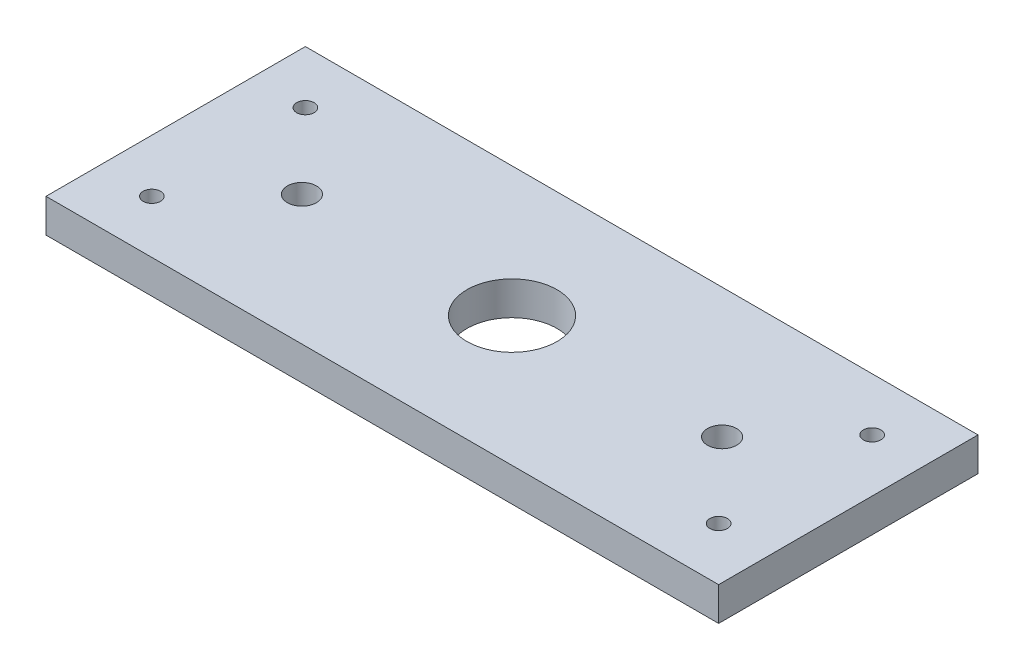
ISO-10303-21;
HEADER;
FILE_DESCRIPTION(('STEP AP214'),'2;1');
FILE_NAME('part.step','',(''),(''),'','','');
FILE_SCHEMA(('AUTOMOTIVE_DESIGN { 1 0 10303 214 1 1 1 1 }'));
ENDSEC;
DATA;
#1=APPLICATION_CONTEXT('core data for automotive mechanical design processes');
#2=APPLICATION_PROTOCOL_DEFINITION('international standard','automotive_design',2000,#1);
#3=PRODUCT_CONTEXT('',#1,'mechanical');
#4=PRODUCT('Part','Part','',(#3));
#5=PRODUCT_RELATED_PRODUCT_CATEGORY('part','',(#4));
#6=PRODUCT_DEFINITION_FORMATION('','',#4);
#7=PRODUCT_DEFINITION_CONTEXT('part definition',#1,'design');
#8=PRODUCT_DEFINITION('design','',#6,#7);
#9=PRODUCT_DEFINITION_SHAPE('','',#8);
#10=(LENGTH_UNIT() NAMED_UNIT(*) SI_UNIT(.MILLI.,.METRE.));
#11=(NAMED_UNIT(*) PLANE_ANGLE_UNIT() SI_UNIT($,.RADIAN.));
#12=(NAMED_UNIT(*) SI_UNIT($,.STERADIAN.) SOLID_ANGLE_UNIT());
#13=UNCERTAINTY_MEASURE_WITH_UNIT(LENGTH_MEASURE(1.E-05),#10,'distance_accuracy_value','');
#14=(GEOMETRIC_REPRESENTATION_CONTEXT(3) GLOBAL_UNCERTAINTY_ASSIGNED_CONTEXT((#13)) GLOBAL_UNIT_ASSIGNED_CONTEXT((#10,
#11,#12)) REPRESENTATION_CONTEXT('',''));
#15=CARTESIAN_POINT('',(0.,0.,0.));
#16=DIRECTION('',(0.,0.,1.));
#17=DIRECTION('',(1.,0.,0.));
#18=AXIS2_PLACEMENT_3D('',#15,#16,#17);
#19=CARTESIAN_POINT('',(0.,6.35,0.));
#20=DIRECTION('',(0.,1.,0.));
#21=DIRECTION('',(0.,0.,1.));
#22=AXIS2_PLACEMENT_3D('',#19,#20,#21);
#23=PLANE('',#22);
#24=CARTESIAN_POINT('',(39.6875,6.35,0.));
#25=DIRECTION('',(0.,1.,0.));
#26=DIRECTION('',(0.,0.,-1.));
#27=AXIS2_PLACEMENT_3D('',#24,#25,#26);
#28=CIRCLE('',#27,2.74999999999999);
#29=CARTESIAN_POINT('',(39.6875,6.35,-2.74999999999999));
#30=VERTEX_POINT('',#29);
#31=EDGE_CURVE('E172',#30,#30,#28,.T.);
#32=ORIENTED_EDGE('',*,*,#31,.F.);
#33=EDGE_LOOP('',(#32));
#34=FACE_BOUND('',#33,.T.);
#35=CARTESIAN_POINT('',(-53.533775,6.35,14.5));
#36=DIRECTION('',(0.,1.,0.));
#37=DIRECTION('',(0.,0.,1.));
#38=AXIS2_PLACEMENT_3D('',#35,#36,#37);
#39=CIRCLE('',#38,1.64999999999999);
#40=CARTESIAN_POINT('',(-53.533775,6.35,16.15));
#41=VERTEX_POINT('',#40);
#42=EDGE_CURVE('E156',#41,#41,#39,.T.);
#43=ORIENTED_EDGE('',*,*,#42,.F.);
#44=EDGE_LOOP('',(#43));
#45=FACE_BOUND('',#44,.T.);
#46=CARTESIAN_POINT('',(-39.6875,6.35,0.));
#47=DIRECTION('',(0.,1.,0.));
#48=DIRECTION('',(0.,0.,1.));
#49=AXIS2_PLACEMENT_3D('',#46,#47,#48);
#50=CIRCLE('',#49,2.74999999999999);
#51=CARTESIAN_POINT('',(-39.6875,6.35,2.74999999999999));
#52=VERTEX_POINT('',#51);
#53=EDGE_CURVE('E140',#52,#52,#50,.T.);
#54=ORIENTED_EDGE('',*,*,#53,.F.);
#55=EDGE_LOOP('',(#54));
#56=FACE_BOUND('',#55,.T.);
#57=DIRECTION('',(0.,0.,1.));
#58=VECTOR('',#57,1.);
#59=CARTESIAN_POINT('',(-63.533775,6.35,-24.5));
#60=LINE('',#59,#58);
#61=CARTESIAN_POINT('',(-63.533775,6.35,-24.5));
#62=VERTEX_POINT('',#61);
#63=CARTESIAN_POINT('',(-63.533775,6.35,24.5));
#64=VERTEX_POINT('',#63);
#65=EDGE_CURVE('E98',#62,#64,#60,.T.);
#66=ORIENTED_EDGE('',*,*,#65,.T.);
#67=DIRECTION('',(1.,0.,0.));
#68=VECTOR('',#67,1.);
#69=CARTESIAN_POINT('',(-63.533775,6.35,24.5));
#70=LINE('',#69,#68);
#71=CARTESIAN_POINT('',(63.533775,6.35,24.5));
#72=VERTEX_POINT('',#71);
#73=EDGE_CURVE('E93',#64,#72,#70,.T.);
#74=ORIENTED_EDGE('',*,*,#73,.T.);
#75=DIRECTION('',(0.,0.,-1.));
#76=VECTOR('',#75,1.);
#77=CARTESIAN_POINT('',(63.533775,6.35,-24.5));
#78=LINE('',#77,#76);
#79=CARTESIAN_POINT('',(63.533775,6.35,-24.5));
#80=VERTEX_POINT('',#79);
#81=EDGE_CURVE('E96',#72,#80,#78,.T.);
#82=ORIENTED_EDGE('',*,*,#81,.T.);
#83=DIRECTION('',(-1.,0.,0.));
#84=VECTOR('',#83,1.);
#85=CARTESIAN_POINT('',(-63.533775,6.35,-24.5));
#86=LINE('',#85,#84);
#87=EDGE_CURVE('E63',#80,#62,#86,.T.);
#88=ORIENTED_EDGE('',*,*,#87,.T.);
#89=EDGE_LOOP('',(#66,#74,#82,#88));
#90=FACE_BOUND('',#89,.T.);
#91=CARTESIAN_POINT('',(0.,6.35,0.));
#92=DIRECTION('',(0.,1.,0.));
#93=DIRECTION('',(0.,0.,1.));
#94=AXIS2_PLACEMENT_3D('',#91,#92,#93);
#95=CIRCLE('',#94,8.5);
#96=CARTESIAN_POINT('',(0.,6.35,8.5));
#97=VERTEX_POINT('',#96);
#98=EDGE_CURVE('E118',#97,#97,#95,.T.);
#99=ORIENTED_EDGE('',*,*,#98,.F.);
#100=EDGE_LOOP('',(#99));
#101=FACE_BOUND('',#100,.T.);
#102=CARTESIAN_POINT('',(-53.533775,6.35,-14.5));
#103=DIRECTION('',(0.,1.,0.));
#104=DIRECTION('',(0.,0.,1.));
#105=AXIS2_PLACEMENT_3D('',#102,#103,#104);
#106=CIRCLE('',#105,1.64999999999999);
#107=CARTESIAN_POINT('',(-53.533775,6.35,-12.85));
#108=VERTEX_POINT('',#107);
#109=EDGE_CURVE('E148',#108,#108,#106,.T.);
#110=ORIENTED_EDGE('',*,*,#109,.F.);
#111=EDGE_LOOP('',(#110));
#112=FACE_BOUND('',#111,.T.);
#113=CARTESIAN_POINT('',(53.533775,6.35,-14.5));
#114=DIRECTION('',(0.,1.,0.));
#115=DIRECTION('',(0.,0.,-1.));
#116=AXIS2_PLACEMENT_3D('',#113,#114,#115);
#117=CIRCLE('',#116,1.64999999999999);
#118=CARTESIAN_POINT('',(53.533775,6.35,-16.15));
#119=VERTEX_POINT('',#118);
#120=EDGE_CURVE('E164',#119,#119,#117,.T.);
#121=ORIENTED_EDGE('',*,*,#120,.F.);
#122=EDGE_LOOP('',(#121));
#123=FACE_BOUND('',#122,.T.);
#124=CARTESIAN_POINT('',(53.533775,6.35,14.5));
#125=DIRECTION('',(0.,1.,0.));
#126=DIRECTION('',(0.,0.,-1.));
#127=AXIS2_PLACEMENT_3D('',#124,#125,#126);
#128=CIRCLE('',#127,1.64999999999999);
#129=CARTESIAN_POINT('',(53.533775,6.35,12.85));
#130=VERTEX_POINT('',#129);
#131=EDGE_CURVE('E180',#130,#130,#128,.T.);
#132=ORIENTED_EDGE('',*,*,#131,.F.);
#133=EDGE_LOOP('',(#132));
#134=FACE_BOUND('',#133,.T.);
#135=ADVANCED_FACE('F45',(#34,#45,#56,#90,#101,#112,#123,#134),#23,.T.);
#136=CARTESIAN_POINT('',(0.,0.,0.));
#137=DIRECTION('',(0.,1.,0.));
#138=DIRECTION('',(0.,0.,1.));
#139=AXIS2_PLACEMENT_3D('',#136,#137,#138);
#140=PLANE('',#139);
#141=DIRECTION('',(0.,0.,1.));
#142=VECTOR('',#141,1.);
#143=CARTESIAN_POINT('',(-63.533775,0.,-24.5));
#144=LINE('',#143,#142);
#145=CARTESIAN_POINT('',(-63.533775,0.,-24.5));
#146=VERTEX_POINT('',#145);
#147=CARTESIAN_POINT('',(-63.533775,0.,24.5));
#148=VERTEX_POINT('',#147);
#149=EDGE_CURVE('E114',#146,#148,#144,.T.);
#150=ORIENTED_EDGE('',*,*,#149,.F.);
#151=DIRECTION('',(-1.,0.,0.));
#152=VECTOR('',#151,1.);
#153=CARTESIAN_POINT('',(-63.533775,0.,-24.5));
#154=LINE('',#153,#152);
#155=CARTESIAN_POINT('',(63.533775,0.,-24.5));
#156=VERTEX_POINT('',#155);
#157=EDGE_CURVE('E86',#156,#146,#154,.T.);
#158=ORIENTED_EDGE('',*,*,#157,.F.);
#159=DIRECTION('',(0.,0.,-1.));
#160=VECTOR('',#159,1.);
#161=CARTESIAN_POINT('',(63.533775,0.,-24.5));
#162=LINE('',#161,#160);
#163=CARTESIAN_POINT('',(63.533775,0.,24.5));
#164=VERTEX_POINT('',#163);
#165=EDGE_CURVE('E80',#164,#156,#162,.T.);
#166=ORIENTED_EDGE('',*,*,#165,.F.);
#167=DIRECTION('',(1.,0.,0.));
#168=VECTOR('',#167,1.);
#169=CARTESIAN_POINT('',(-63.533775,0.,24.5));
#170=LINE('',#169,#168);
#171=EDGE_CURVE('E103',#148,#164,#170,.T.);
#172=ORIENTED_EDGE('',*,*,#171,.F.);
#173=EDGE_LOOP('',(#150,#158,#166,#172));
#174=FACE_BOUND('',#173,.T.);
#175=CARTESIAN_POINT('',(0.,0.,0.));
#176=DIRECTION('',(0.,1.,0.));
#177=DIRECTION('',(0.,0.,1.));
#178=AXIS2_PLACEMENT_3D('',#175,#176,#177);
#179=CIRCLE('',#178,8.5);
#180=CARTESIAN_POINT('',(0.,0.,8.5));
#181=VERTEX_POINT('',#180);
#182=EDGE_CURVE('E136',#181,#181,#179,.T.);
#183=ORIENTED_EDGE('',*,*,#182,.T.);
#184=EDGE_LOOP('',(#183));
#185=FACE_BOUND('',#184,.T.);
#186=CARTESIAN_POINT('',(-39.6875,0.,0.));
#187=DIRECTION('',(0.,1.,0.));
#188=DIRECTION('',(0.,0.,1.));
#189=AXIS2_PLACEMENT_3D('',#186,#187,#188);
#190=CIRCLE('',#189,2.74999999999999);
#191=CARTESIAN_POINT('',(-39.6875,0.,2.74999999999999));
#192=VERTEX_POINT('',#191);
#193=EDGE_CURVE('E144',#192,#192,#190,.T.);
#194=ORIENTED_EDGE('',*,*,#193,.T.);
#195=EDGE_LOOP('',(#194));
#196=FACE_BOUND('',#195,.T.);
#197=CARTESIAN_POINT('',(-53.533775,0.,-14.5));
#198=DIRECTION('',(0.,1.,0.));
#199=DIRECTION('',(0.,0.,1.));
#200=AXIS2_PLACEMENT_3D('',#197,#198,#199);
#201=CIRCLE('',#200,1.64999999999999);
#202=CARTESIAN_POINT('',(-53.533775,0.,-12.85));
#203=VERTEX_POINT('',#202);
#204=EDGE_CURVE('E152',#203,#203,#201,.T.);
#205=ORIENTED_EDGE('',*,*,#204,.T.);
#206=EDGE_LOOP('',(#205));
#207=FACE_BOUND('',#206,.T.);
#208=CARTESIAN_POINT('',(-53.533775,0.,14.5));
#209=DIRECTION('',(0.,1.,0.));
#210=DIRECTION('',(0.,0.,1.));
#211=AXIS2_PLACEMENT_3D('',#208,#209,#210);
#212=CIRCLE('',#211,1.64999999999999);
#213=CARTESIAN_POINT('',(-53.533775,0.,16.15));
#214=VERTEX_POINT('',#213);
#215=EDGE_CURVE('E160',#214,#214,#212,.T.);
#216=ORIENTED_EDGE('',*,*,#215,.T.);
#217=EDGE_LOOP('',(#216));
#218=FACE_BOUND('',#217,.T.);
#219=CARTESIAN_POINT('',(53.533775,0.,-14.5));
#220=DIRECTION('',(0.,1.,0.));
#221=DIRECTION('',(0.,0.,-1.));
#222=AXIS2_PLACEMENT_3D('',#219,#220,#221);
#223=CIRCLE('',#222,1.64999999999999);
#224=CARTESIAN_POINT('',(53.533775,0.,-16.15));
#225=VERTEX_POINT('',#224);
#226=EDGE_CURVE('E168',#225,#225,#223,.T.);
#227=ORIENTED_EDGE('',*,*,#226,.T.);
#228=EDGE_LOOP('',(#227));
#229=FACE_BOUND('',#228,.T.);
#230=CARTESIAN_POINT('',(39.6875,0.,0.));
#231=DIRECTION('',(0.,1.,0.));
#232=DIRECTION('',(0.,0.,-1.));
#233=AXIS2_PLACEMENT_3D('',#230,#231,#232);
#234=CIRCLE('',#233,2.74999999999999);
#235=CARTESIAN_POINT('',(39.6875,0.,-2.74999999999999));
#236=VERTEX_POINT('',#235);
#237=EDGE_CURVE('E176',#236,#236,#234,.T.);
#238=ORIENTED_EDGE('',*,*,#237,.T.);
#239=EDGE_LOOP('',(#238));
#240=FACE_BOUND('',#239,.T.);
#241=CARTESIAN_POINT('',(53.533775,0.,14.5));
#242=DIRECTION('',(0.,1.,0.));
#243=DIRECTION('',(0.,0.,-1.));
#244=AXIS2_PLACEMENT_3D('',#241,#242,#243);
#245=CIRCLE('',#244,1.64999999999999);
#246=CARTESIAN_POINT('',(53.533775,0.,12.85));
#247=VERTEX_POINT('',#246);
#248=EDGE_CURVE('E184',#247,#247,#245,.T.);
#249=ORIENTED_EDGE('',*,*,#248,.T.);
#250=EDGE_LOOP('',(#249));
#251=FACE_BOUND('',#250,.T.);
#252=ADVANCED_FACE('F131',(#174,#185,#196,#207,#218,#229,#240,#251),#140,.F.);
#253=CARTESIAN_POINT('',(-63.533775,6.35,-24.5));
#254=DIRECTION('',(1.,0.,0.));
#255=DIRECTION('',(0.,0.,-1.));
#256=AXIS2_PLACEMENT_3D('',#253,#254,#255);
#257=PLANE('',#256);
#258=ORIENTED_EDGE('',*,*,#149,.T.);
#259=DIRECTION('',(0.,-1.,0.));
#260=VECTOR('',#259,1.);
#261=CARTESIAN_POINT('',(-63.533775,6.35,24.5));
#262=LINE('',#261,#260);
#263=EDGE_CURVE('E11',#64,#148,#262,.T.);
#264=ORIENTED_EDGE('',*,*,#263,.F.);
#265=ORIENTED_EDGE('',*,*,#65,.F.);
#266=DIRECTION('',(0.,-1.,0.));
#267=VECTOR('',#266,1.);
#268=CARTESIAN_POINT('',(-63.533775,6.35,-24.5));
#269=LINE('',#268,#267);
#270=EDGE_CURVE('E110',#62,#146,#269,.T.);
#271=ORIENTED_EDGE('',*,*,#270,.T.);
#272=EDGE_LOOP('',(#258,#264,#265,#271));
#273=FACE_BOUND('',#272,.T.);
#274=ADVANCED_FACE('F47',(#273),#257,.F.);
#275=CARTESIAN_POINT('',(-63.533775,6.35,24.5));
#276=DIRECTION('',(0.,0.,-1.));
#277=DIRECTION('',(-1.,0.,0.));
#278=AXIS2_PLACEMENT_3D('',#275,#276,#277);
#279=PLANE('',#278);
#280=ORIENTED_EDGE('',*,*,#171,.T.);
#281=DIRECTION('',(0.,-1.,0.));
#282=VECTOR('',#281,1.);
#283=CARTESIAN_POINT('',(63.533775,6.35,24.5));
#284=LINE('',#283,#282);
#285=EDGE_CURVE('E55',#72,#164,#284,.T.);
#286=ORIENTED_EDGE('',*,*,#285,.F.);
#287=ORIENTED_EDGE('',*,*,#73,.F.);
#288=ORIENTED_EDGE('',*,*,#263,.T.);
#289=EDGE_LOOP('',(#280,#286,#287,#288));
#290=FACE_BOUND('',#289,.T.);
#291=ADVANCED_FACE('F102',(#290),#279,.F.);
#292=CARTESIAN_POINT('',(63.533775,6.35,-24.5));
#293=DIRECTION('',(-1.,0.,0.));
#294=DIRECTION('',(0.,0.,1.));
#295=AXIS2_PLACEMENT_3D('',#292,#293,#294);
#296=PLANE('',#295);
#297=ORIENTED_EDGE('',*,*,#165,.T.);
#298=DIRECTION('',(0.,-1.,0.));
#299=VECTOR('',#298,1.);
#300=CARTESIAN_POINT('',(63.533775,6.35,-24.5));
#301=LINE('',#300,#299);
#302=EDGE_CURVE('E105',#80,#156,#301,.T.);
#303=ORIENTED_EDGE('',*,*,#302,.F.);
#304=ORIENTED_EDGE('',*,*,#81,.F.);
#305=ORIENTED_EDGE('',*,*,#285,.T.);
#306=EDGE_LOOP('',(#297,#303,#304,#305));
#307=FACE_BOUND('',#306,.T.);
#308=ADVANCED_FACE('F106',(#307),#296,.F.);
#309=CARTESIAN_POINT('',(-63.533775,6.35,-24.5));
#310=DIRECTION('',(0.,0.,1.));
#311=DIRECTION('',(1.,0.,0.));
#312=AXIS2_PLACEMENT_3D('',#309,#310,#311);
#313=PLANE('',#312);
#314=ORIENTED_EDGE('',*,*,#157,.T.);
#315=ORIENTED_EDGE('',*,*,#270,.F.);
#316=ORIENTED_EDGE('',*,*,#87,.F.);
#317=ORIENTED_EDGE('',*,*,#302,.T.);
#318=EDGE_LOOP('',(#314,#315,#316,#317));
#319=FACE_BOUND('',#318,.T.);
#320=ADVANCED_FACE('F128',(#319),#313,.F.);
#321=CARTESIAN_POINT('',(0.,6.35,0.));
#322=DIRECTION('',(0.,-1.,0.));
#323=DIRECTION('',(0.,0.,-1.));
#324=AXIS2_PLACEMENT_3D('',#321,#322,#323);
#325=CYLINDRICAL_SURFACE('',#324,8.5);
#326=ORIENTED_EDGE('',*,*,#98,.T.);
#327=EDGE_LOOP('',(#326));
#328=FACE_BOUND('',#327,.T.);
#329=ORIENTED_EDGE('',*,*,#182,.F.);
#330=EDGE_LOOP('',(#329));
#331=FACE_BOUND('',#330,.T.);
#332=ADVANCED_FACE('F205',(#328,#331),#325,.F.);
#333=CARTESIAN_POINT('',(-39.6875,6.35,0.));
#334=DIRECTION('',(0.,-1.,0.));
#335=DIRECTION('',(0.,0.,-1.));
#336=AXIS2_PLACEMENT_3D('',#333,#334,#335);
#337=CYLINDRICAL_SURFACE('',#336,2.74999999999999);
#338=ORIENTED_EDGE('',*,*,#53,.T.);
#339=EDGE_LOOP('',(#338));
#340=FACE_BOUND('',#339,.T.);
#341=ORIENTED_EDGE('',*,*,#193,.F.);
#342=EDGE_LOOP('',(#341));
#343=FACE_BOUND('',#342,.T.);
#344=ADVANCED_FACE('F250',(#340,#343),#337,.F.);
#345=CARTESIAN_POINT('',(-53.533775,6.35,-14.5));
#346=DIRECTION('',(0.,-1.,0.));
#347=DIRECTION('',(0.,0.,-1.));
#348=AXIS2_PLACEMENT_3D('',#345,#346,#347);
#349=CYLINDRICAL_SURFACE('',#348,1.64999999999999);
#350=ORIENTED_EDGE('',*,*,#109,.T.);
#351=EDGE_LOOP('',(#350));
#352=FACE_BOUND('',#351,.T.);
#353=ORIENTED_EDGE('',*,*,#204,.F.);
#354=EDGE_LOOP('',(#353));
#355=FACE_BOUND('',#354,.T.);
#356=ADVANCED_FACE('F258',(#352,#355),#349,.F.);
#357=CARTESIAN_POINT('',(-53.533775,6.35,14.5));
#358=DIRECTION('',(0.,-1.,0.));
#359=DIRECTION('',(0.,0.,-1.));
#360=AXIS2_PLACEMENT_3D('',#357,#358,#359);
#361=CYLINDRICAL_SURFACE('',#360,1.64999999999999);
#362=ORIENTED_EDGE('',*,*,#42,.T.);
#363=EDGE_LOOP('',(#362));
#364=FACE_BOUND('',#363,.T.);
#365=ORIENTED_EDGE('',*,*,#215,.F.);
#366=EDGE_LOOP('',(#365));
#367=FACE_BOUND('',#366,.T.);
#368=ADVANCED_FACE('F266',(#364,#367),#361,.F.);
#369=CARTESIAN_POINT('',(53.533775,6.35,-14.5));
#370=DIRECTION('',(0.,-1.,0.));
#371=DIRECTION('',(0.,0.,-1.));
#372=AXIS2_PLACEMENT_3D('',#369,#370,#371);
#373=CYLINDRICAL_SURFACE('',#372,1.64999999999999);
#374=ORIENTED_EDGE('',*,*,#120,.T.);
#375=EDGE_LOOP('',(#374));
#376=FACE_BOUND('',#375,.T.);
#377=ORIENTED_EDGE('',*,*,#226,.F.);
#378=EDGE_LOOP('',(#377));
#379=FACE_BOUND('',#378,.T.);
#380=ADVANCED_FACE('F275',(#376,#379),#373,.F.);
#381=CARTESIAN_POINT('',(39.6875,6.35,0.));
#382=DIRECTION('',(0.,-1.,0.));
#383=DIRECTION('',(0.,0.,-1.));
#384=AXIS2_PLACEMENT_3D('',#381,#382,#383);
#385=CYLINDRICAL_SURFACE('',#384,2.74999999999999);
#386=ORIENTED_EDGE('',*,*,#31,.T.);
#387=EDGE_LOOP('',(#386));
#388=FACE_BOUND('',#387,.T.);
#389=ORIENTED_EDGE('',*,*,#237,.F.);
#390=EDGE_LOOP('',(#389));
#391=FACE_BOUND('',#390,.T.);
#392=ADVANCED_FACE('F284',(#388,#391),#385,.F.);
#393=CARTESIAN_POINT('',(53.533775,6.35,14.5));
#394=DIRECTION('',(0.,-1.,0.));
#395=DIRECTION('',(0.,0.,-1.));
#396=AXIS2_PLACEMENT_3D('',#393,#394,#395);
#397=CYLINDRICAL_SURFACE('',#396,1.64999999999999);
#398=ORIENTED_EDGE('',*,*,#131,.T.);
#399=EDGE_LOOP('',(#398));
#400=FACE_BOUND('',#399,.T.);
#401=ORIENTED_EDGE('',*,*,#248,.F.);
#402=EDGE_LOOP('',(#401));
#403=FACE_BOUND('',#402,.T.);
#404=ADVANCED_FACE('F192',(#400,#403),#397,.F.);
#405=CLOSED_SHELL('',(#135,#252,#274,#291,#308,#320,#332,#344,#356,#368,#380,#392,#404));
#406=MANIFOLD_SOLID_BREP('B2',#405);
#407=ADVANCED_BREP_SHAPE_REPRESENTATION('',(#18,#406),#14);
#408=SHAPE_DEFINITION_REPRESENTATION(#9,#407);
ENDSEC;
END-ISO-10303-21;
